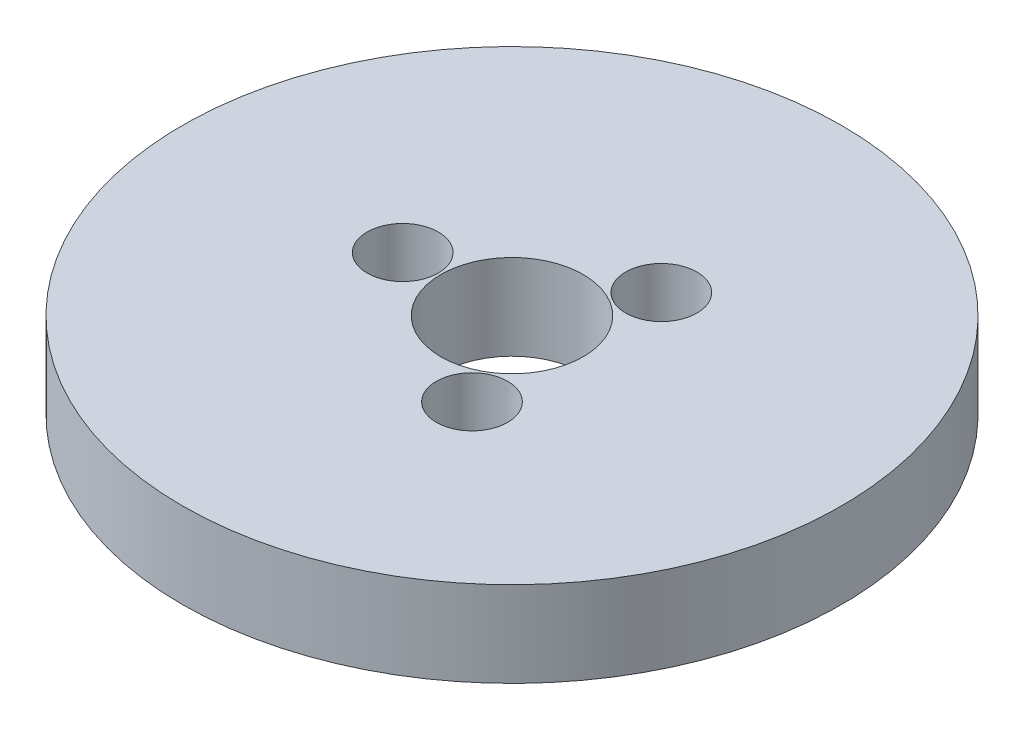
ISO-10303-21;
HEADER;
FILE_DESCRIPTION(('STEP AP214'),'2;1');
FILE_NAME('part.step','',(''),(''),'','','');
FILE_SCHEMA(('AUTOMOTIVE_DESIGN { 1 0 10303 214 1 1 1 1 }'));
ENDSEC;
DATA;
#1=APPLICATION_CONTEXT('core data for automotive mechanical design processes');
#2=APPLICATION_PROTOCOL_DEFINITION('international standard','automotive_design',2000,#1);
#3=PRODUCT_CONTEXT('',#1,'mechanical');
#4=PRODUCT('Part','Part','',(#3));
#5=PRODUCT_RELATED_PRODUCT_CATEGORY('part','',(#4));
#6=PRODUCT_DEFINITION_FORMATION('','',#4);
#7=PRODUCT_DEFINITION_CONTEXT('part definition',#1,'design');
#8=PRODUCT_DEFINITION('design','',#6,#7);
#9=PRODUCT_DEFINITION_SHAPE('','',#8);
#10=(LENGTH_UNIT() NAMED_UNIT(*) SI_UNIT(.MILLI.,.METRE.));
#11=(NAMED_UNIT(*) PLANE_ANGLE_UNIT() SI_UNIT($,.RADIAN.));
#12=(NAMED_UNIT(*) SI_UNIT($,.STERADIAN.) SOLID_ANGLE_UNIT());
#13=UNCERTAINTY_MEASURE_WITH_UNIT(LENGTH_MEASURE(1.E-05),#10,'distance_accuracy_value','');
#14=(GEOMETRIC_REPRESENTATION_CONTEXT(3) GLOBAL_UNCERTAINTY_ASSIGNED_CONTEXT((#13)) GLOBAL_UNIT_ASSIGNED_CONTEXT((#10,
#11,#12)) REPRESENTATION_CONTEXT('',''));
#15=CARTESIAN_POINT('',(0.,0.,0.));
#16=DIRECTION('',(0.,0.,1.));
#17=DIRECTION('',(1.,0.,0.));
#18=AXIS2_PLACEMENT_3D('',#15,#16,#17);
#19=CARTESIAN_POINT('',(0.,24.,0.));
#20=DIRECTION('',(0.,-1.,0.));
#21=DIRECTION('',(0.,0.,-1.));
#22=AXIS2_PLACEMENT_3D('',#19,#20,#21);
#23=CYLINDRICAL_SURFACE('',#22,92.5);
#24=CARTESIAN_POINT('',(0.,24.,0.));
#25=DIRECTION('',(0.,1.,0.));
#26=DIRECTION('',(0.,0.,1.));
#27=AXIS2_PLACEMENT_3D('',#24,#25,#26);
#28=CIRCLE('',#27,92.5);
#29=CARTESIAN_POINT('',(0.,24.,92.5));
#30=VERTEX_POINT('',#29);
#31=EDGE_CURVE('E10',#30,#30,#28,.T.);
#32=ORIENTED_EDGE('',*,*,#31,.F.);
#33=EDGE_LOOP('',(#32));
#34=FACE_BOUND('',#33,.T.);
#35=CARTESIAN_POINT('',(0.,0.,0.));
#36=DIRECTION('',(0.,1.,0.));
#37=DIRECTION('',(0.,0.,1.));
#38=AXIS2_PLACEMENT_3D('',#35,#36,#37);
#39=CIRCLE('',#38,92.5);
#40=CARTESIAN_POINT('',(0.,0.,92.5));
#41=VERTEX_POINT('',#40);
#42=EDGE_CURVE('E37',#41,#41,#39,.T.);
#43=ORIENTED_EDGE('',*,*,#42,.T.);
#44=EDGE_LOOP('',(#43));
#45=FACE_BOUND('',#44,.T.);
#46=ADVANCED_FACE('F40',(#34,#45),#23,.T.);
#47=CARTESIAN_POINT('',(0.,24.,0.));
#48=DIRECTION('',(0.,1.,0.));
#49=DIRECTION('',(0.,0.,1.));
#50=AXIS2_PLACEMENT_3D('',#47,#48,#49);
#51=PLANE('',#50);
#52=CARTESIAN_POINT('',(15.3381463426708,24.,26.5664487594322));
#53=DIRECTION('',(0.,1.,0.));
#54=DIRECTION('',(0.866025403784436,0.,-0.500000000000004));
#55=AXIS2_PLACEMENT_3D('',#52,#53,#54);
#56=CIRCLE('',#55,10.);
#57=CARTESIAN_POINT('',(23.9984003805151,24.,21.5664487594322));
#58=VERTEX_POINT('',#57);
#59=EDGE_CURVE('E70',#58,#58,#56,.T.);
#60=ORIENTED_EDGE('',*,*,#59,.F.);
#61=EDGE_LOOP('',(#60));
#62=FACE_BOUND('',#61,.T.);
#63=CARTESIAN_POINT('',(15.3381463426704,24.,-26.5664487594324));
#64=DIRECTION('',(0.,1.,0.));
#65=DIRECTION('',(-0.866025403784443,0.,-0.499999999999992));
#66=AXIS2_PLACEMENT_3D('',#63,#64,#65);
#67=CIRCLE('',#66,10.);
#68=CARTESIAN_POINT('',(6.67789230482596,24.,-31.5664487594324));
#69=VERTEX_POINT('',#68);
#70=EDGE_CURVE('E61',#69,#69,#67,.T.);
#71=ORIENTED_EDGE('',*,*,#70,.F.);
#72=EDGE_LOOP('',(#71));
#73=FACE_BOUND('',#72,.T.);
#74=CARTESIAN_POINT('',(-30.6762926853413,24.,0.));
#75=DIRECTION('',(0.,1.,0.));
#76=DIRECTION('',(0.,0.,1.));
#77=AXIS2_PLACEMENT_3D('',#74,#75,#76);
#78=CIRCLE('',#77,10.);
#79=CARTESIAN_POINT('',(-30.6762926853413,24.,10.));
#80=VERTEX_POINT('',#79);
#81=EDGE_CURVE('E54',#80,#80,#78,.T.);
#82=ORIENTED_EDGE('',*,*,#81,.F.);
#83=EDGE_LOOP('',(#82));
#84=FACE_BOUND('',#83,.T.);
#85=CARTESIAN_POINT('',(0.,24.,0.));
#86=DIRECTION('',(0.,1.,0.));
#87=DIRECTION('',(0.,0.,1.));
#88=AXIS2_PLACEMENT_3D('',#85,#86,#87);
#89=CIRCLE('',#88,20.);
#90=CARTESIAN_POINT('',(0.,24.,20.));
#91=VERTEX_POINT('',#90);
#92=EDGE_CURVE('E50',#91,#91,#89,.T.);
#93=ORIENTED_EDGE('',*,*,#92,.F.);
#94=EDGE_LOOP('',(#93));
#95=FACE_BOUND('',#94,.T.);
#96=ORIENTED_EDGE('',*,*,#31,.T.);
#97=EDGE_LOOP('',(#96));
#98=FACE_BOUND('',#97,.T.);
#99=ADVANCED_FACE('F85',(#62,#73,#84,#95,#98),#51,.T.);
#100=CARTESIAN_POINT('',(0.,0.,0.));
#101=DIRECTION('',(0.,1.,0.));
#102=DIRECTION('',(0.,0.,1.));
#103=AXIS2_PLACEMENT_3D('',#100,#101,#102);
#104=PLANE('',#103);
#105=CARTESIAN_POINT('',(0.,0.,0.));
#106=DIRECTION('',(0.,1.,0.));
#107=DIRECTION('',(0.,0.,1.));
#108=AXIS2_PLACEMENT_3D('',#105,#106,#107);
#109=CIRCLE('',#108,20.);
#110=CARTESIAN_POINT('',(0.,0.,20.));
#111=VERTEX_POINT('',#110);
#112=EDGE_CURVE('E47',#111,#111,#109,.T.);
#113=ORIENTED_EDGE('',*,*,#112,.T.);
#114=EDGE_LOOP('',(#113));
#115=FACE_BOUND('',#114,.T.);
#116=ORIENTED_EDGE('',*,*,#42,.F.);
#117=EDGE_LOOP('',(#116));
#118=FACE_BOUND('',#117,.T.);
#119=ADVANCED_FACE('F84',(#115,#118),#104,.F.);
#120=CARTESIAN_POINT('',(0.,24.,0.));
#121=DIRECTION('',(0.,-1.,0.));
#122=DIRECTION('',(0.,0.,-1.));
#123=AXIS2_PLACEMENT_3D('',#120,#121,#122);
#124=CYLINDRICAL_SURFACE('',#123,20.);
#125=ORIENTED_EDGE('',*,*,#92,.T.);
#126=EDGE_LOOP('',(#125));
#127=FACE_BOUND('',#126,.T.);
#128=ORIENTED_EDGE('',*,*,#112,.F.);
#129=EDGE_LOOP('',(#128));
#130=FACE_BOUND('',#129,.T.);
#131=ADVANCED_FACE('F91',(#127,#130),#124,.F.);
#132=CARTESIAN_POINT('',(-30.6762926853413,3.85808045923259,0.));
#133=DIRECTION('',(0.,1.,0.));
#134=DIRECTION('',(0.,0.,1.));
#135=AXIS2_PLACEMENT_3D('',#132,#133,#134);
#136=CYLINDRICAL_SURFACE('',#135,10.);
#137=CARTESIAN_POINT('',(-30.6762926853413,3.85808045923259,0.));
#138=DIRECTION('',(0.,1.,0.));
#139=DIRECTION('',(0.,0.,1.));
#140=AXIS2_PLACEMENT_3D('',#137,#138,#139);
#141=CIRCLE('',#140,10.);
#142=CARTESIAN_POINT('',(-30.6762926853413,3.85808045923259,10.));
#143=VERTEX_POINT('',#142);
#144=EDGE_CURVE('E55',#143,#143,#141,.T.);
#145=ORIENTED_EDGE('',*,*,#144,.F.);
#146=EDGE_LOOP('',(#145));
#147=FACE_BOUND('',#146,.T.);
#148=ORIENTED_EDGE('',*,*,#81,.T.);
#149=EDGE_LOOP('',(#148));
#150=FACE_BOUND('',#149,.T.);
#151=ADVANCED_FACE('F96',(#147,#150),#136,.F.);
#152=CARTESIAN_POINT('',(-30.6762926853413,3.85808045923259,0.));
#153=DIRECTION('',(0.,1.,0.));
#154=DIRECTION('',(0.,0.,1.));
#155=AXIS2_PLACEMENT_3D('',#152,#153,#154);
#156=PLANE('',#155);
#157=ORIENTED_EDGE('',*,*,#144,.T.);
#158=EDGE_LOOP('',(#157));
#159=FACE_BOUND('',#158,.T.);
#160=ADVANCED_FACE('F127',(#159),#156,.T.);
#161=CARTESIAN_POINT('',(15.3381463426704,3.85808045923259,-26.5664487594324));
#162=DIRECTION('',(0.,1.,0.));
#163=DIRECTION('',(0.,0.,1.));
#164=AXIS2_PLACEMENT_3D('',#161,#162,#163);
#165=CYLINDRICAL_SURFACE('',#164,10.);
#166=CARTESIAN_POINT('',(15.3381463426704,3.85808045923259,-26.5664487594324));
#167=DIRECTION('',(0.,1.,0.));
#168=DIRECTION('',(-0.866025403784443,0.,-0.499999999999992));
#169=AXIS2_PLACEMENT_3D('',#166,#167,#168);
#170=CIRCLE('',#169,10.);
#171=CARTESIAN_POINT('',(6.67789230482596,3.85808045923259,-31.5664487594324));
#172=VERTEX_POINT('',#171);
#173=EDGE_CURVE('E63',#172,#172,#170,.T.);
#174=ORIENTED_EDGE('',*,*,#173,.F.);
#175=EDGE_LOOP('',(#174));
#176=FACE_BOUND('',#175,.T.);
#177=ORIENTED_EDGE('',*,*,#70,.T.);
#178=EDGE_LOOP('',(#177));
#179=FACE_BOUND('',#178,.T.);
#180=ADVANCED_FACE('F133',(#176,#179),#165,.F.);
#181=CARTESIAN_POINT('',(15.3381463426704,3.85808045923259,-26.5664487594324));
#182=DIRECTION('',(0.,1.,0.));
#183=DIRECTION('',(-0.866025403784443,0.,-0.499999999999992));
#184=AXIS2_PLACEMENT_3D('',#181,#182,#183);
#185=PLANE('',#184);
#186=ORIENTED_EDGE('',*,*,#173,.T.);
#187=EDGE_LOOP('',(#186));
#188=FACE_BOUND('',#187,.T.);
#189=ADVANCED_FACE('F77',(#188),#185,.T.);
#190=CARTESIAN_POINT('',(15.3381463426708,3.85808045923259,26.5664487594322));
#191=DIRECTION('',(0.,1.,0.));
#192=DIRECTION('',(0.,0.,1.));
#193=AXIS2_PLACEMENT_3D('',#190,#191,#192);
#194=CYLINDRICAL_SURFACE('',#193,10.);
#195=CARTESIAN_POINT('',(15.3381463426708,3.85808045923259,26.5664487594322));
#196=DIRECTION('',(0.,1.,0.));
#197=DIRECTION('',(0.866025403784436,0.,-0.500000000000004));
#198=AXIS2_PLACEMENT_3D('',#195,#196,#197);
#199=CIRCLE('',#198,10.);
#200=CARTESIAN_POINT('',(23.9984003805151,3.85808045923259,21.5664487594322));
#201=VERTEX_POINT('',#200);
#202=EDGE_CURVE('E59',#201,#201,#199,.T.);
#203=ORIENTED_EDGE('',*,*,#202,.F.);
#204=EDGE_LOOP('',(#203));
#205=FACE_BOUND('',#204,.T.);
#206=ORIENTED_EDGE('',*,*,#59,.T.);
#207=EDGE_LOOP('',(#206));
#208=FACE_BOUND('',#207,.T.);
#209=ADVANCED_FACE('F73',(#205,#208),#194,.F.);
#210=CARTESIAN_POINT('',(15.3381463426708,3.85808045923259,26.5664487594322));
#211=DIRECTION('',(0.,1.,0.));
#212=DIRECTION('',(0.866025403784436,0.,-0.500000000000004));
#213=AXIS2_PLACEMENT_3D('',#210,#211,#212);
#214=PLANE('',#213);
#215=ORIENTED_EDGE('',*,*,#202,.T.);
#216=EDGE_LOOP('',(#215));
#217=FACE_BOUND('',#216,.T.);
#218=ADVANCED_FACE('F71',(#217),#214,.T.);
#219=CLOSED_SHELL('',(#46,#99,#119,#131,#151,#160,#180,#189,#209,#218));
#220=MANIFOLD_SOLID_BREP('B2',#219);
#221=ADVANCED_BREP_SHAPE_REPRESENTATION('',(#18,#220),#14);
#222=SHAPE_DEFINITION_REPRESENTATION(#9,#221);
ENDSEC;
END-ISO-10303-21;
